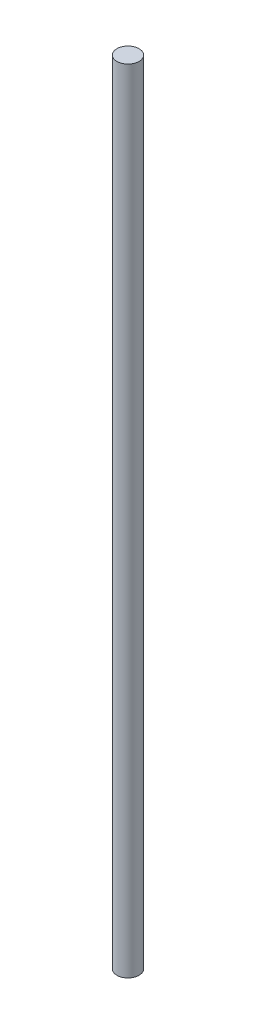
ISO-10303-21;
HEADER;
FILE_DESCRIPTION(('STEP AP214'),'2;1');
FILE_NAME('part.step','',(''),(''),'','','');
FILE_SCHEMA(('AUTOMOTIVE_DESIGN { 1 0 10303 214 1 1 1 1 }'));
ENDSEC;
DATA;
#1=APPLICATION_CONTEXT('core data for automotive mechanical design processes');
#2=APPLICATION_PROTOCOL_DEFINITION('international standard','automotive_design',2000,#1);
#3=PRODUCT_CONTEXT('',#1,'mechanical');
#4=PRODUCT('Part','Part','',(#3));
#5=PRODUCT_RELATED_PRODUCT_CATEGORY('part','',(#4));
#6=PRODUCT_DEFINITION_FORMATION('','',#4);
#7=PRODUCT_DEFINITION_CONTEXT('part definition',#1,'design');
#8=PRODUCT_DEFINITION('design','',#6,#7);
#9=PRODUCT_DEFINITION_SHAPE('','',#8);
#10=(LENGTH_UNIT() NAMED_UNIT(*) SI_UNIT(.MILLI.,.METRE.));
#11=(NAMED_UNIT(*) PLANE_ANGLE_UNIT() SI_UNIT($,.RADIAN.));
#12=(NAMED_UNIT(*) SI_UNIT($,.STERADIAN.) SOLID_ANGLE_UNIT());
#13=UNCERTAINTY_MEASURE_WITH_UNIT(LENGTH_MEASURE(1.E-05),#10,'distance_accuracy_value','');
#14=(GEOMETRIC_REPRESENTATION_CONTEXT(3) GLOBAL_UNCERTAINTY_ASSIGNED_CONTEXT((#13)) GLOBAL_UNIT_ASSIGNED_CONTEXT((#10,
#11,#12)) REPRESENTATION_CONTEXT('',''));
#15=CARTESIAN_POINT('',(0.,0.,0.));
#16=DIRECTION('',(0.,0.,1.));
#17=DIRECTION('',(1.,0.,0.));
#18=AXIS2_PLACEMENT_3D('',#15,#16,#17);
#19=CARTESIAN_POINT('',(0.,286.,0.));
#20=DIRECTION('',(0.,-1.,0.));
#21=DIRECTION('',(0.,0.,-1.));
#22=AXIS2_PLACEMENT_3D('',#19,#20,#21);
#23=CYLINDRICAL_SURFACE('',#22,4.);
#24=CARTESIAN_POINT('',(0.,286.,0.));
#25=DIRECTION('',(0.,1.,0.));
#26=DIRECTION('',(0.,0.,1.));
#27=AXIS2_PLACEMENT_3D('',#24,#25,#26);
#28=CIRCLE('',#27,4.);
#29=CARTESIAN_POINT('',(0.,286.,4.));
#30=VERTEX_POINT('',#29);
#31=EDGE_CURVE('E10',#30,#30,#28,.T.);
#32=ORIENTED_EDGE('',*,*,#31,.F.);
#33=EDGE_LOOP('',(#32));
#34=FACE_BOUND('',#33,.T.);
#35=CARTESIAN_POINT('',(0.,0.,0.));
#36=DIRECTION('',(0.,1.,0.));
#37=DIRECTION('',(0.,0.,1.));
#38=AXIS2_PLACEMENT_3D('',#35,#36,#37);
#39=CIRCLE('',#38,4.);
#40=CARTESIAN_POINT('',(0.,0.,4.));
#41=VERTEX_POINT('',#40);
#42=EDGE_CURVE('E34',#41,#41,#39,.T.);
#43=ORIENTED_EDGE('',*,*,#42,.T.);
#44=EDGE_LOOP('',(#43));
#45=FACE_BOUND('',#44,.T.);
#46=ADVANCED_FACE('F31',(#34,#45),#23,.T.);
#47=CARTESIAN_POINT('',(0.,286.,0.));
#48=DIRECTION('',(0.,1.,0.));
#49=DIRECTION('',(0.,0.,1.));
#50=AXIS2_PLACEMENT_3D('',#47,#48,#49);
#51=PLANE('',#50);
#52=ORIENTED_EDGE('',*,*,#31,.T.);
#53=EDGE_LOOP('',(#52));
#54=FACE_BOUND('',#53,.T.);
#55=ADVANCED_FACE('F46',(#54),#51,.T.);
#56=CARTESIAN_POINT('',(0.,0.,0.));
#57=DIRECTION('',(0.,1.,0.));
#58=DIRECTION('',(0.,0.,1.));
#59=AXIS2_PLACEMENT_3D('',#56,#57,#58);
#60=PLANE('',#59);
#61=ORIENTED_EDGE('',*,*,#42,.F.);
#62=EDGE_LOOP('',(#61));
#63=FACE_BOUND('',#62,.T.);
#64=ADVANCED_FACE('F44',(#63),#60,.F.);
#65=CLOSED_SHELL('',(#46,#55,#64));
#66=MANIFOLD_SOLID_BREP('B2',#65);
#67=ADVANCED_BREP_SHAPE_REPRESENTATION('',(#18,#66),#14);
#68=SHAPE_DEFINITION_REPRESENTATION(#9,#67);
ENDSEC;
END-ISO-10303-21;
